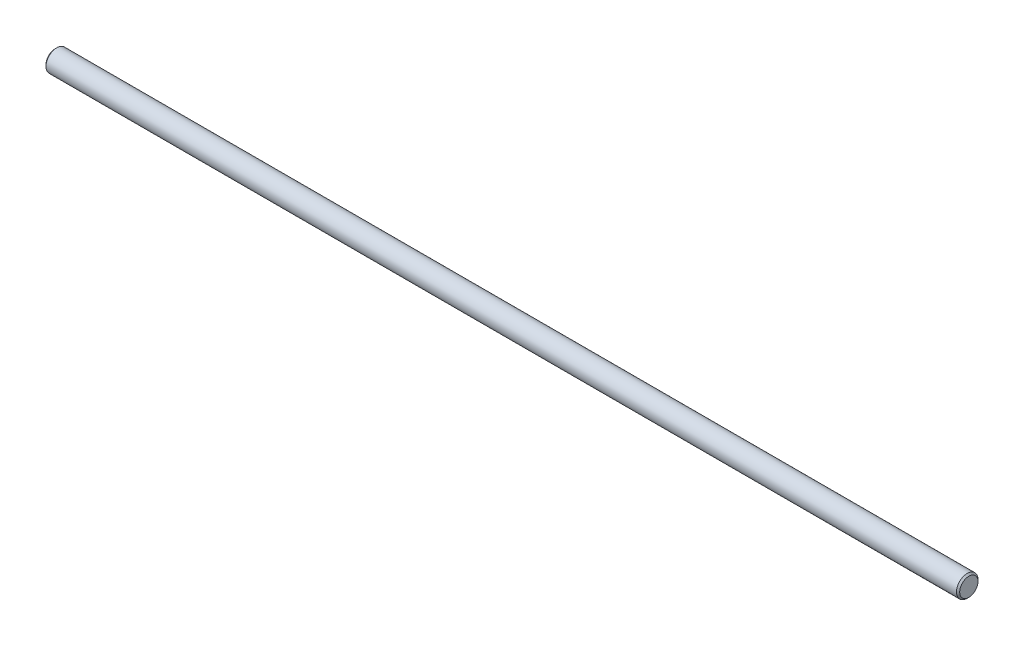
ISO-10303-21;
HEADER;
FILE_DESCRIPTION(('STEP AP214'),'2;1');
FILE_NAME('part.step','',(''),(''),'','','');
FILE_SCHEMA(('AUTOMOTIVE_DESIGN { 1 0 10303 214 1 1 1 1 }'));
ENDSEC;
DATA;
#1=APPLICATION_CONTEXT('core data for automotive mechanical design processes');
#2=APPLICATION_PROTOCOL_DEFINITION('international standard','automotive_design',2000,#1);
#3=PRODUCT_CONTEXT('',#1,'mechanical');
#4=PRODUCT('Part','Part','',(#3));
#5=PRODUCT_RELATED_PRODUCT_CATEGORY('part','',(#4));
#6=PRODUCT_DEFINITION_FORMATION('','',#4);
#7=PRODUCT_DEFINITION_CONTEXT('part definition',#1,'design');
#8=PRODUCT_DEFINITION('design','',#6,#7);
#9=PRODUCT_DEFINITION_SHAPE('','',#8);
#10=(LENGTH_UNIT() NAMED_UNIT(*) SI_UNIT(.MILLI.,.METRE.));
#11=(NAMED_UNIT(*) PLANE_ANGLE_UNIT() SI_UNIT($,.RADIAN.));
#12=(NAMED_UNIT(*) SI_UNIT($,.STERADIAN.) SOLID_ANGLE_UNIT());
#13=UNCERTAINTY_MEASURE_WITH_UNIT(LENGTH_MEASURE(1.E-05),#10,'distance_accuracy_value','');
#14=(GEOMETRIC_REPRESENTATION_CONTEXT(3) GLOBAL_UNCERTAINTY_ASSIGNED_CONTEXT((#13)) GLOBAL_UNIT_ASSIGNED_CONTEXT((#10,
#11,#12)) REPRESENTATION_CONTEXT('',''));
#15=CARTESIAN_POINT('',(0.,0.,0.));
#16=DIRECTION('',(0.,0.,1.));
#17=DIRECTION('',(1.,0.,0.));
#18=AXIS2_PLACEMENT_3D('',#15,#16,#17);
#19=CARTESIAN_POINT('',(-168.275,0.,0.));
#20=DIRECTION('',(1.,0.,0.));
#21=DIRECTION('',(0.,0.,-1.));
#22=AXIS2_PLACEMENT_3D('',#19,#20,#21);
#23=CYLINDRICAL_SURFACE('',#22,3.96875);
#24=CARTESIAN_POINT('',(-167.6796875,0.,0.));
#25=DIRECTION('',(1.,0.,0.));
#26=DIRECTION('',(0.,0.,-1.));
#27=AXIS2_PLACEMENT_3D('',#24,#25,#26);
#28=CIRCLE('',#27,3.96875);
#29=CARTESIAN_POINT('',(-167.6796875,0.,-3.96875));
#30=VERTEX_POINT('',#29);
#31=EDGE_CURVE('E45',#30,#30,#28,.T.);
#32=ORIENTED_EDGE('',*,*,#31,.T.);
#33=EDGE_LOOP('',(#32));
#34=FACE_BOUND('',#33,.T.);
#35=CARTESIAN_POINT('',(167.6796875,0.,0.));
#36=DIRECTION('',(1.,0.,0.));
#37=DIRECTION('',(0.,0.,-1.));
#38=AXIS2_PLACEMENT_3D('',#35,#36,#37);
#39=CIRCLE('',#38,3.96875);
#40=CARTESIAN_POINT('',(167.6796875,0.,-3.96875));
#41=VERTEX_POINT('',#40);
#42=EDGE_CURVE('E49',#41,#41,#39,.F.);
#43=ORIENTED_EDGE('',*,*,#42,.T.);
#44=EDGE_LOOP('',(#43));
#45=FACE_BOUND('',#44,.T.);
#46=ADVANCED_FACE('F34',(#34,#45),#23,.T.);
#47=CARTESIAN_POINT('',(-168.275,0.,0.));
#48=DIRECTION('',(1.,0.,0.));
#49=DIRECTION('',(0.,0.,-1.));
#50=AXIS2_PLACEMENT_3D('',#47,#48,#49);
#51=PLANE('',#50);
#52=CARTESIAN_POINT('',(-168.275,0.,0.));
#53=DIRECTION('',(1.,0.,0.));
#54=DIRECTION('',(0.,0.,-1.));
#55=AXIS2_PLACEMENT_3D('',#52,#53,#54);
#56=CIRCLE('',#55,3.37343750000005);
#57=CARTESIAN_POINT('',(-168.275,0.,-3.37343750000005));
#58=VERTEX_POINT('',#57);
#59=EDGE_CURVE('E41',#58,#58,#56,.F.);
#60=ORIENTED_EDGE('',*,*,#59,.T.);
#61=EDGE_LOOP('',(#60));
#62=FACE_BOUND('',#61,.T.);
#63=ADVANCED_FACE('F65',(#62),#51,.F.);
#64=CARTESIAN_POINT('',(168.275,0.,0.));
#65=DIRECTION('',(1.,0.,0.));
#66=DIRECTION('',(0.,0.,-1.));
#67=AXIS2_PLACEMENT_3D('',#64,#65,#66);
#68=PLANE('',#67);
#69=CARTESIAN_POINT('',(168.275,0.,0.));
#70=DIRECTION('',(1.,0.,0.));
#71=DIRECTION('',(0.,0.,-1.));
#72=AXIS2_PLACEMENT_3D('',#69,#70,#71);
#73=CIRCLE('',#72,3.37343749999999);
#74=CARTESIAN_POINT('',(168.275,0.,-3.37343749999999));
#75=VERTEX_POINT('',#74);
#76=EDGE_CURVE('E10',#75,#75,#73,.T.);
#77=ORIENTED_EDGE('',*,*,#76,.T.);
#78=EDGE_LOOP('',(#77));
#79=FACE_BOUND('',#78,.T.);
#80=ADVANCED_FACE('F62',(#79),#68,.T.);
#81=CARTESIAN_POINT('',(-167.6796875,0.,0.));
#82=DIRECTION('',(1.,0.,0.));
#83=DIRECTION('',(0.,0.,-1.));
#84=AXIS2_PLACEMENT_3D('',#81,#82,#83);
#85=CONICAL_SURFACE('',#84,3.96875,0.785398163397431);
#86=ORIENTED_EDGE('',*,*,#59,.F.);
#87=EDGE_LOOP('',(#86));
#88=FACE_BOUND('',#87,.T.);
#89=ORIENTED_EDGE('',*,*,#31,.F.);
#90=EDGE_LOOP('',(#89));
#91=FACE_BOUND('',#90,.T.);
#92=ADVANCED_FACE('F58',(#88,#91),#85,.T.);
#93=CARTESIAN_POINT('',(168.275,0.,0.));
#94=DIRECTION('',(-1.,0.,0.));
#95=DIRECTION('',(0.,0.,1.));
#96=AXIS2_PLACEMENT_3D('',#93,#94,#95);
#97=CONICAL_SURFACE('',#96,3.37343749999999,0.785398163397408);
#98=ORIENTED_EDGE('',*,*,#42,.F.);
#99=EDGE_LOOP('',(#98));
#100=FACE_BOUND('',#99,.T.);
#101=ORIENTED_EDGE('',*,*,#76,.F.);
#102=EDGE_LOOP('',(#101));
#103=FACE_BOUND('',#102,.T.);
#104=ADVANCED_FACE('F36',(#100,#103),#97,.T.);
#105=CLOSED_SHELL('',(#46,#63,#80,#92,#104));
#106=MANIFOLD_SOLID_BREP('B2',#105);
#107=ADVANCED_BREP_SHAPE_REPRESENTATION('',(#18,#106),#14);
#108=SHAPE_DEFINITION_REPRESENTATION(#9,#107);
ENDSEC;
END-ISO-10303-21;
